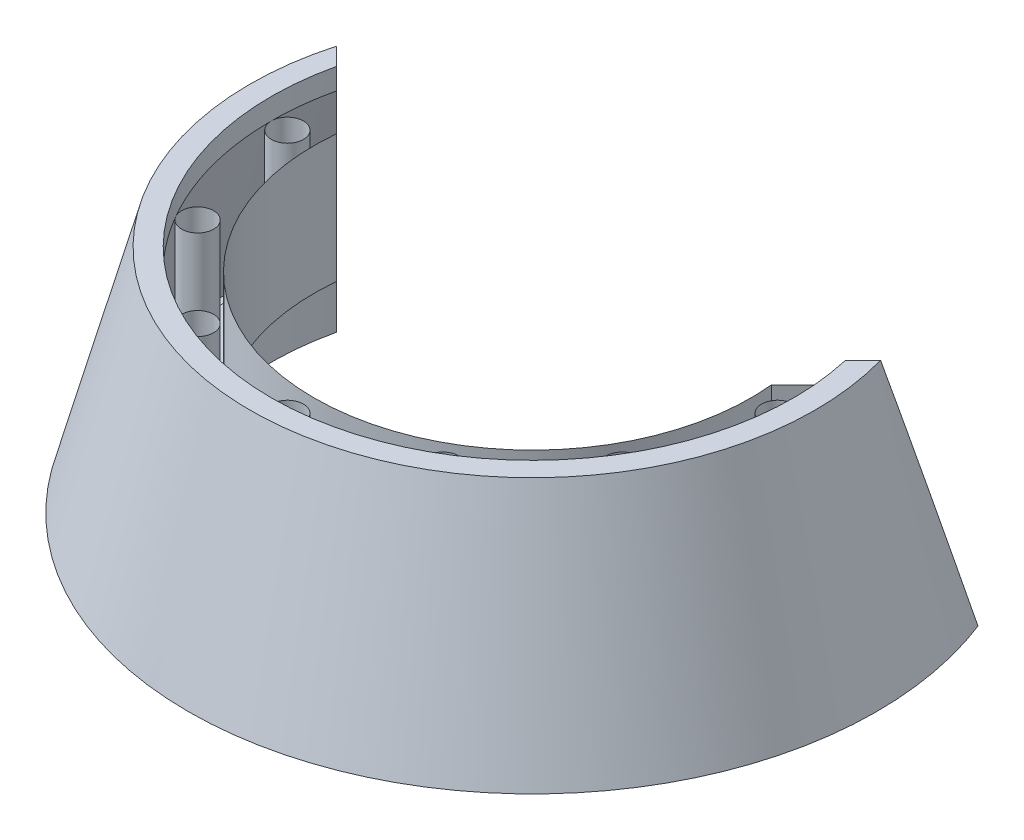
ISO-10303-21;
HEADER;
FILE_DESCRIPTION(('STEP AP214'),'2;1');
FILE_NAME('part.step','',(''),(''),'','','');
FILE_SCHEMA(('AUTOMOTIVE_DESIGN { 1 0 10303 214 1 1 1 1 }'));
ENDSEC;
DATA;
#1=APPLICATION_CONTEXT('core data for automotive mechanical design processes');
#2=APPLICATION_PROTOCOL_DEFINITION('international standard','automotive_design',2000,#1);
#3=PRODUCT_CONTEXT('',#1,'mechanical');
#4=PRODUCT('Part','Part','',(#3));
#5=PRODUCT_RELATED_PRODUCT_CATEGORY('part','',(#4));
#6=PRODUCT_DEFINITION_FORMATION('','',#4);
#7=PRODUCT_DEFINITION_CONTEXT('part definition',#1,'design');
#8=PRODUCT_DEFINITION('design','',#6,#7);
#9=PRODUCT_DEFINITION_SHAPE('','',#8);
#10=(LENGTH_UNIT() NAMED_UNIT(*) SI_UNIT(.MILLI.,.METRE.));
#11=(NAMED_UNIT(*) PLANE_ANGLE_UNIT() SI_UNIT($,.RADIAN.));
#12=(NAMED_UNIT(*) SI_UNIT($,.STERADIAN.) SOLID_ANGLE_UNIT());
#13=UNCERTAINTY_MEASURE_WITH_UNIT(LENGTH_MEASURE(1.E-05),#10,'distance_accuracy_value','');
#14=(GEOMETRIC_REPRESENTATION_CONTEXT(3) GLOBAL_UNCERTAINTY_ASSIGNED_CONTEXT((#13)) GLOBAL_UNIT_ASSIGNED_CONTEXT((#10,
#11,#12)) REPRESENTATION_CONTEXT('',''));
#15=CARTESIAN_POINT('',(0.,0.,0.));
#16=DIRECTION('',(0.,0.,1.));
#17=DIRECTION('',(1.,0.,0.));
#18=AXIS2_PLACEMENT_3D('',#15,#16,#17);
#19=CARTESIAN_POINT('',(0.,-19.05,-77.7875));
#20=DIRECTION('',(0.,-1.,0.));
#21=DIRECTION('',(0.,0.,-1.));
#22=AXIS2_PLACEMENT_3D('',#19,#20,#21);
#23=PLANE('',#22);
#24=DIRECTION('',(-0.707106781186546,0.,-0.707106781186549));
#25=VECTOR('',#24,1.);
#26=CARTESIAN_POINT('',(-68.0795823934747,-19.05,-9.70791760652553));
#27=LINE('',#26,#25);
#28=CARTESIAN_POINT('',(-64.7720448306673,-19.05,-6.40038004371812));
#29=VERTEX_POINT('',#28);
#30=CARTESIAN_POINT('',(-75.8080885124679,-19.05,-17.4364237255188));
#31=VERTEX_POINT('',#30);
#32=EDGE_CURVE('E61',#29,#31,#27,.T.);
#33=ORIENTED_EDGE('',*,*,#32,.F.);
#34=CARTESIAN_POINT('',(0.,-19.05,0.));
#35=DIRECTION('',(0.,-1.,0.));
#36=DIRECTION('',(0.,0.,-1.));
#37=AXIS2_PLACEMENT_3D('',#34,#35,#36);
#38=CIRCLE('',#37,65.0875);
#39=CARTESIAN_POINT('',(64.7720448306673,-19.05,-6.4003800437177));
#40=VERTEX_POINT('',#39);
#41=EDGE_CURVE('E194',#40,#29,#38,.T.);
#42=ORIENTED_EDGE('',*,*,#41,.F.);
#43=DIRECTION('',(-0.707106781186549,0.,0.707106781186546));
#44=VECTOR('',#43,1.);
#45=CARTESIAN_POINT('',(68.0795823934747,-19.05,-9.70791760652506));
#46=LINE('',#45,#44);
#47=CARTESIAN_POINT('',(75.808088512468,-19.05,-17.4364237255183));
#48=VERTEX_POINT('',#47);
#49=EDGE_CURVE('E163',#48,#40,#46,.T.);
#50=ORIENTED_EDGE('',*,*,#49,.F.);
#51=CARTESIAN_POINT('',(0.,-19.05,0.));
#52=DIRECTION('',(0.,-1.,0.));
#53=DIRECTION('',(0.,0.,-1.));
#54=AXIS2_PLACEMENT_3D('',#51,#52,#53);
#55=CIRCLE('',#54,77.7875);
#56=CARTESIAN_POINT('',(77.7875,-19.05,8.07034740519042E-13));
#57=VERTEX_POINT('',#56);
#58=EDGE_CURVE('E205',#48,#57,#55,.T.);
#59=ORIENTED_EDGE('',*,*,#58,.T.);
#60=CARTESIAN_POINT('',(73.025,-19.05,7.55953291056286E-13));
#61=DIRECTION('',(0.,-1.,0.));
#62=DIRECTION('',(0.,0.,-1.));
#63=AXIS2_PLACEMENT_3D('',#60,#61,#62);
#64=CIRCLE('',#63,4.76249999999999);
#65=EDGE_CURVE('E316',#57,#57,#64,.T.);
#66=ORIENTED_EDGE('',*,*,#65,.F.);
#67=CARTESIAN_POINT('',(67.3659510968816,-19.05,38.8937500000008));
#68=VERTEX_POINT('',#67);
#69=EDGE_CURVE('E214',#57,#68,#55,.T.);
#70=ORIENTED_EDGE('',*,*,#69,.T.);
#71=CARTESIAN_POINT('',(63.2415051113582,-19.05,36.5125000000007));
#72=DIRECTION('',(0.,-1.,0.));
#73=DIRECTION('',(0.,0.,-1.));
#74=AXIS2_PLACEMENT_3D('',#71,#72,#73);
#75=CIRCLE('',#74,4.76249999999999);
#76=EDGE_CURVE('E313',#68,#68,#75,.T.);
#77=ORIENTED_EDGE('',*,*,#76,.F.);
#78=CARTESIAN_POINT('',(38.8937499999991,-19.05,67.3659510968825));
#79=VERTEX_POINT('',#78);
#80=EDGE_CURVE('E222',#68,#79,#55,.T.);
#81=ORIENTED_EDGE('',*,*,#80,.T.);
#82=CARTESIAN_POINT('',(36.5124999999992,-19.05,63.2415051113591));
#83=DIRECTION('',(0.,-1.,0.));
#84=DIRECTION('',(0.,0.,-1.));
#85=AXIS2_PLACEMENT_3D('',#82,#83,#84);
#86=CIRCLE('',#85,4.76249999999999);
#87=EDGE_CURVE('E310',#79,#79,#86,.T.);
#88=ORIENTED_EDGE('',*,*,#87,.F.);
#89=CARTESIAN_POINT('',(0.,-19.05,77.7875));
#90=VERTEX_POINT('',#89);
#91=EDGE_CURVE('E217',#79,#90,#55,.T.);
#92=ORIENTED_EDGE('',*,*,#91,.T.);
#93=CARTESIAN_POINT('',(0.,-19.05,73.025));
#94=DIRECTION('',(0.,-1.,0.));
#95=DIRECTION('',(0.,0.,-1.));
#96=AXIS2_PLACEMENT_3D('',#93,#94,#95);
#97=CIRCLE('',#96,4.76249999999999);
#98=EDGE_CURVE('E225',#90,#90,#97,.T.);
#99=ORIENTED_EDGE('',*,*,#98,.F.);
#100=CARTESIAN_POINT('',(-38.8937500000001,-19.05,67.365951096882));
#101=VERTEX_POINT('',#100);
#102=EDGE_CURVE('E176',#90,#101,#55,.T.);
#103=ORIENTED_EDGE('',*,*,#102,.T.);
#104=CARTESIAN_POINT('',(-36.5125000000001,-19.05,63.2415051113586));
#105=DIRECTION('',(0.,-1.,0.));
#106=DIRECTION('',(0.,0.,-1.));
#107=AXIS2_PLACEMENT_3D('',#104,#105,#106);
#108=CIRCLE('',#107,4.76249999999999);
#109=EDGE_CURVE('E307',#101,#101,#108,.T.);
#110=ORIENTED_EDGE('',*,*,#109,.F.);
#111=CARTESIAN_POINT('',(-67.3659510968821,-19.05,38.8937499999999));
#112=VERTEX_POINT('',#111);
#113=EDGE_CURVE('E228',#101,#112,#55,.T.);
#114=ORIENTED_EDGE('',*,*,#113,.T.);
#115=CARTESIAN_POINT('',(-63.2415051113587,-19.05,36.5124999999999));
#116=DIRECTION('',(0.,-1.,0.));
#117=DIRECTION('',(0.,0.,-1.));
#118=AXIS2_PLACEMENT_3D('',#115,#116,#117);
#119=CIRCLE('',#118,4.76249999999999);
#120=EDGE_CURVE('E242',#112,#112,#119,.T.);
#121=ORIENTED_EDGE('',*,*,#120,.F.);
#122=CARTESIAN_POINT('',(-77.7875,-19.05,-2.62067383356393E-13));
#123=VERTEX_POINT('',#122);
#124=EDGE_CURVE('E221',#112,#123,#55,.T.);
#125=ORIENTED_EDGE('',*,*,#124,.T.);
#126=CARTESIAN_POINT('',(-73.025,-19.05,-2.46022441518246E-13));
#127=DIRECTION('',(0.,-1.,0.));
#128=DIRECTION('',(0.,0.,-1.));
#129=AXIS2_PLACEMENT_3D('',#126,#127,#128);
#130=CIRCLE('',#129,4.76249999999999);
#131=EDGE_CURVE('E240',#123,#123,#130,.T.);
#132=ORIENTED_EDGE('',*,*,#131,.F.);
#133=EDGE_CURVE('E216',#123,#31,#55,.T.);
#134=ORIENTED_EDGE('',*,*,#133,.T.);
#135=EDGE_LOOP('',(#33,#42,#50,#59,#66,#70,#77,#81,#88,#92,#99,#103,#110,#114,#121,#125,#132,#134));
#136=FACE_BOUND('',#135,.T.);
#137=ADVANCED_FACE('F39',(#136),#23,.T.);
#138=CARTESIAN_POINT('',(0.,-44.45,0.));
#139=DIRECTION('',(0.,-1.,0.));
#140=DIRECTION('',(0.,0.,-1.));
#141=AXIS2_PLACEMENT_3D('',#138,#139,#140);
#142=CYLINDRICAL_SURFACE('',#141,65.0875);
#143=DIRECTION('',(0.,-1.,0.));
#144=VECTOR('',#143,1.);
#145=CARTESIAN_POINT('',(-64.7720448306673,-44.45,-6.40038004371813));
#146=LINE('',#145,#144);
#147=CARTESIAN_POINT('',(-64.7720448306673,19.05,-6.40038004371813));
#148=VERTEX_POINT('',#147);
#149=EDGE_CURVE('E244',#148,#29,#146,.T.);
#150=ORIENTED_EDGE('',*,*,#149,.F.);
#151=CARTESIAN_POINT('',(0.,19.05,0.));
#152=DIRECTION('',(0.,-1.,0.));
#153=DIRECTION('',(0.,0.,-1.));
#154=AXIS2_PLACEMENT_3D('',#151,#152,#153);
#155=CIRCLE('',#154,65.0875);
#156=CARTESIAN_POINT('',(64.7720448306673,19.05,-6.40038004371773));
#157=VERTEX_POINT('',#156);
#158=EDGE_CURVE('E188',#157,#148,#155,.T.);
#159=ORIENTED_EDGE('',*,*,#158,.F.);
#160=DIRECTION('',(0.,-1.,0.));
#161=VECTOR('',#160,1.);
#162=CARTESIAN_POINT('',(64.7720448306673,-44.45,-6.40038004371773));
#163=LINE('',#162,#161);
#164=EDGE_CURVE('E208',#40,#157,#163,.F.);
#165=ORIENTED_EDGE('',*,*,#164,.F.);
#166=ORIENTED_EDGE('',*,*,#41,.T.);
#167=EDGE_LOOP('',(#150,#159,#165,#166));
#168=FACE_BOUND('',#167,.T.);
#169=ADVANCED_FACE('F248',(#168),#142,.F.);
#170=CARTESIAN_POINT('',(0.,19.05,-65.0875));
#171=DIRECTION('',(0.,1.,0.));
#172=DIRECTION('',(0.,0.,1.));
#173=AXIS2_PLACEMENT_3D('',#170,#171,#172);
#174=PLANE('',#173);
#175=DIRECTION('',(0.707106781186546,0.,0.707106781186549));
#176=VECTOR('',#175,1.);
#177=CARTESIAN_POINT('',(-61.7295823934747,19.05,-3.35791760652552));
#178=LINE('',#177,#176);
#179=CARTESIAN_POINT('',(-75.8080885124679,19.05,-17.4364237255188));
#180=VERTEX_POINT('',#179);
#181=EDGE_CURVE('E413',#180,#148,#178,.T.);
#182=ORIENTED_EDGE('',*,*,#181,.F.);
#183=CARTESIAN_POINT('',(0.,19.05,0.));
#184=DIRECTION('',(0.,-1.,0.));
#185=DIRECTION('',(0.,0.,-1.));
#186=AXIS2_PLACEMENT_3D('',#183,#184,#185);
#187=CIRCLE('',#186,77.7875);
#188=CARTESIAN_POINT('',(-77.7875,19.05,-2.62067383356393E-13));
#189=VERTEX_POINT('',#188);
#190=EDGE_CURVE('E361',#189,#180,#187,.T.);
#191=ORIENTED_EDGE('',*,*,#190,.F.);
#192=CARTESIAN_POINT('',(-73.025,19.05,-2.46022441518246E-13));
#193=DIRECTION('',(0.,1.,0.));
#194=DIRECTION('',(-1.,0.,0.));
#195=AXIS2_PLACEMENT_3D('',#192,#193,#194);
#196=CIRCLE('',#195,4.76249999999999);
#197=EDGE_CURVE('E299',#189,#189,#196,.T.);
#198=ORIENTED_EDGE('',*,*,#197,.F.);
#199=CARTESIAN_POINT('',(-67.3659510968821,19.05,38.8937499999998));
#200=VERTEX_POINT('',#199);
#201=EDGE_CURVE('E365',#200,#189,#187,.T.);
#202=ORIENTED_EDGE('',*,*,#201,.F.);
#203=CARTESIAN_POINT('',(-63.2415051113587,19.05,36.5124999999999));
#204=DIRECTION('',(0.,1.,0.));
#205=DIRECTION('',(-0.86602540378444,0.,0.499999999999998));
#206=AXIS2_PLACEMENT_3D('',#203,#204,#205);
#207=CIRCLE('',#206,4.76249999999999);
#208=EDGE_CURVE('E295',#200,#200,#207,.T.);
#209=ORIENTED_EDGE('',*,*,#208,.F.);
#210=CARTESIAN_POINT('',(-38.8937500000001,19.05,67.365951096882));
#211=VERTEX_POINT('',#210);
#212=EDGE_CURVE('E189',#211,#200,#187,.T.);
#213=ORIENTED_EDGE('',*,*,#212,.F.);
#214=CARTESIAN_POINT('',(-36.5125000000001,19.05,63.2415051113586));
#215=DIRECTION('',(0.,1.,0.));
#216=DIRECTION('',(-0.500000000000001,0.,0.866025403784438));
#217=AXIS2_PLACEMENT_3D('',#214,#215,#216);
#218=CIRCLE('',#217,4.76249999999999);
#219=EDGE_CURVE('E298',#211,#211,#218,.T.);
#220=ORIENTED_EDGE('',*,*,#219,.F.);
#221=CARTESIAN_POINT('',(0.,19.05,77.7875));
#222=VERTEX_POINT('',#221);
#223=EDGE_CURVE('E184',#222,#211,#187,.T.);
#224=ORIENTED_EDGE('',*,*,#223,.F.);
#225=CARTESIAN_POINT('',(0.,19.05,73.025));
#226=DIRECTION('',(0.,1.,0.));
#227=DIRECTION('',(0.,0.,1.));
#228=AXIS2_PLACEMENT_3D('',#225,#226,#227);
#229=CIRCLE('',#228,4.76249999999999);
#230=EDGE_CURVE('E323',#222,#222,#229,.T.);
#231=ORIENTED_EDGE('',*,*,#230,.F.);
#232=CARTESIAN_POINT('',(38.8937499999991,19.05,67.3659510968825));
#233=VERTEX_POINT('',#232);
#234=EDGE_CURVE('E183',#233,#222,#187,.T.);
#235=ORIENTED_EDGE('',*,*,#234,.F.);
#236=CARTESIAN_POINT('',(36.5124999999992,19.05,63.2415051113591));
#237=DIRECTION('',(0.,1.,0.));
#238=DIRECTION('',(0.499999999999989,0.,0.866025403784445));
#239=AXIS2_PLACEMENT_3D('',#236,#237,#238);
#240=CIRCLE('',#239,4.76249999999999);
#241=EDGE_CURVE('E286',#233,#233,#240,.T.);
#242=ORIENTED_EDGE('',*,*,#241,.F.);
#243=CARTESIAN_POINT('',(67.3659510968816,19.05,38.8937500000008));
#244=VERTEX_POINT('',#243);
#245=EDGE_CURVE('E352',#244,#233,#187,.T.);
#246=ORIENTED_EDGE('',*,*,#245,.F.);
#247=CARTESIAN_POINT('',(63.2415051113582,19.05,36.5125000000007));
#248=DIRECTION('',(0.,1.,0.));
#249=DIRECTION('',(0.866025403784433,0.,0.50000000000001));
#250=AXIS2_PLACEMENT_3D('',#247,#248,#249);
#251=CIRCLE('',#250,4.76249999999999);
#252=EDGE_CURVE('E289',#244,#244,#251,.T.);
#253=ORIENTED_EDGE('',*,*,#252,.F.);
#254=CARTESIAN_POINT('',(77.7875,19.05,8.05254592646913E-13));
#255=VERTEX_POINT('',#254);
#256=EDGE_CURVE('E349',#255,#244,#187,.T.);
#257=ORIENTED_EDGE('',*,*,#256,.F.);
#258=CARTESIAN_POINT('',(73.025,19.05,7.55953291056286E-13));
#259=DIRECTION('',(0.,1.,0.));
#260=DIRECTION('',(1.,0.,0.));
#261=AXIS2_PLACEMENT_3D('',#258,#259,#260);
#262=CIRCLE('',#261,4.76249999999999);
#263=EDGE_CURVE('E292',#255,#255,#262,.T.);
#264=ORIENTED_EDGE('',*,*,#263,.F.);
#265=CARTESIAN_POINT('',(75.808088512468,19.05,-17.4364237255183));
#266=VERTEX_POINT('',#265);
#267=EDGE_CURVE('E190',#266,#255,#187,.T.);
#268=ORIENTED_EDGE('',*,*,#267,.F.);
#269=DIRECTION('',(0.707106781186549,0.,-0.707106781186546));
#270=VECTOR('',#269,1.);
#271=CARTESIAN_POINT('',(61.7295823934747,19.05,-3.3579176065251));
#272=LINE('',#271,#270);
#273=EDGE_CURVE('E252',#157,#266,#272,.T.);
#274=ORIENTED_EDGE('',*,*,#273,.F.);
#275=ORIENTED_EDGE('',*,*,#158,.T.);
#276=EDGE_LOOP('',(#182,#191,#198,#202,#209,#213,#220,#224,#231,#235,#242,#246,#253,#257,#264,
#268,#274,#275));
#277=FACE_BOUND('',#276,.T.);
#278=ADVANCED_FACE('F346',(#277),#174,.T.);
#279=CARTESIAN_POINT('',(0.,-44.45,0.));
#280=DIRECTION('',(0.,-1.,0.));
#281=DIRECTION('',(0.,0.,-1.));
#282=AXIS2_PLACEMENT_3D('',#279,#280,#281);
#283=CYLINDRICAL_SURFACE('',#282,77.7875);
#284=DIRECTION('',(0.,-1.,0.));
#285=VECTOR('',#284,1.);
#286=CARTESIAN_POINT('',(-75.8080885124679,-44.45,-17.4364237255188));
#287=LINE('',#286,#285);
#288=CARTESIAN_POINT('',(-75.8080885124679,25.4,-17.4364237255188));
#289=VERTEX_POINT('',#288);
#290=EDGE_CURVE('E287',#289,#180,#287,.T.);
#291=ORIENTED_EDGE('',*,*,#290,.F.);
#292=CARTESIAN_POINT('',(0.,25.4,0.));
#293=DIRECTION('',(0.,-1.,0.));
#294=DIRECTION('',(0.,0.,-1.));
#295=AXIS2_PLACEMENT_3D('',#292,#293,#294);
#296=CIRCLE('',#295,77.7875);
#297=CARTESIAN_POINT('',(75.808088512468,25.4,-17.4364237255183));
#298=VERTEX_POINT('',#297);
#299=EDGE_CURVE('E174',#298,#289,#296,.T.);
#300=ORIENTED_EDGE('',*,*,#299,.F.);
#301=DIRECTION('',(0.,-1.,0.));
#302=VECTOR('',#301,1.);
#303=CARTESIAN_POINT('',(75.808088512468,-44.45,-17.4364237255183));
#304=LINE('',#303,#302);
#305=EDGE_CURVE('E152',#266,#298,#304,.F.);
#306=ORIENTED_EDGE('',*,*,#305,.F.);
#307=ORIENTED_EDGE('',*,*,#267,.T.);
#308=ORIENTED_EDGE('',*,*,#256,.T.);
#309=ORIENTED_EDGE('',*,*,#245,.T.);
#310=ORIENTED_EDGE('',*,*,#234,.T.);
#311=ORIENTED_EDGE('',*,*,#223,.T.);
#312=ORIENTED_EDGE('',*,*,#212,.T.);
#313=ORIENTED_EDGE('',*,*,#201,.T.);
#314=ORIENTED_EDGE('',*,*,#190,.T.);
#315=EDGE_LOOP('',(#291,#300,#306,#307,#308,#309,#310,#311,#312,#313,#314));
#316=FACE_BOUND('',#315,.T.);
#317=ADVANCED_FACE('F357',(#316),#283,.F.);
#318=CARTESIAN_POINT('',(0.,25.4,-77.7875));
#319=DIRECTION('',(0.,1.,0.));
#320=DIRECTION('',(0.,0.,1.));
#321=AXIS2_PLACEMENT_3D('',#318,#319,#320);
#322=PLANE('',#321);
#323=DIRECTION('',(0.707106781186546,0.,0.707106781186549));
#324=VECTOR('',#323,1.);
#325=CARTESIAN_POINT('',(0.,25.4,58.3716647869494));
#326=LINE('',#325,#324);
#327=CARTESIAN_POINT('',(-81.0293145356399,25.4,-22.6576497486907));
#328=VERTEX_POINT('',#327);
#329=EDGE_CURVE('E404',#328,#289,#326,.T.);
#330=ORIENTED_EDGE('',*,*,#329,.F.);
#331=CARTESIAN_POINT('',(0.,25.4,0.));
#332=DIRECTION('',(0.,-1.,0.));
#333=DIRECTION('',(0.,0.,-1.));
#334=AXIS2_PLACEMENT_3D('',#331,#332,#333);
#335=CIRCLE('',#334,84.1375);
#336=CARTESIAN_POINT('',(81.02931453564,25.4,-22.6576497486903));
#337=VERTEX_POINT('',#336);
#338=EDGE_CURVE('E170',#337,#328,#335,.T.);
#339=ORIENTED_EDGE('',*,*,#338,.F.);
#340=DIRECTION('',(0.707106781186549,0.,-0.707106781186546));
#341=VECTOR('',#340,1.);
#342=CARTESIAN_POINT('',(0.,25.4,58.3716647869494));
#343=LINE('',#342,#341);
#344=EDGE_CURVE('E146',#298,#337,#343,.T.);
#345=ORIENTED_EDGE('',*,*,#344,.F.);
#346=ORIENTED_EDGE('',*,*,#299,.T.);
#347=EDGE_LOOP('',(#330,#339,#345,#346));
#348=FACE_BOUND('',#347,.T.);
#349=ADVANCED_FACE('F397',(#348),#322,.T.);
#350=CARTESIAN_POINT('',(0.,-43.18,0.));
#351=DIRECTION('',(0.,-1.,0.));
#352=DIRECTION('',(0.,0.,-1.));
#353=AXIS2_PLACEMENT_3D('',#350,#351,#352);
#354=CONICAL_SURFACE('',#353,102.513455616926,0.261799387799146);
#355=CARTESIAN_POINT('',(-95.538654281038,-43.1802,-37.1669894940889));
#356=CARTESIAN_POINT('',(-94.9461315365219,-40.3176112632735,-36.5744667495728));
#357=CARTESIAN_POINT('',(-94.3524292604613,-37.4555112188946,-35.9807644735123));
#358=CARTESIAN_POINT('',(-93.1624544624114,-31.7323789536326,-34.7907896754623));
#359=CARTESIAN_POINT('',(-92.5661819395329,-28.8713467331193,-34.1945171525838));
#360=CARTESIAN_POINT('',(-90.7732066409382,-20.2900564774931,-32.4015418539891));
#361=CARTESIAN_POINT('',(-89.5723324649116,-14.5715387529761,-31.2006676779626));
#362=CARTESIAN_POINT('',(-87.7610908628324,-5.99794864187953,-29.3894260758833));
#363=CARTESIAN_POINT('',(-87.1556874669494,-3.14077769034308,-28.7840226800003));
#364=CARTESIAN_POINT('',(-85.9412453286322,2.57201833314958,-27.5695805416831));
#365=CARTESIAN_POINT('',(-85.3322065871283,5.42764340550113,-26.9605418001792));
#366=CARTESIAN_POINT('',(-84.1101313245328,11.1372171150471,-25.7384665375837));
#367=CARTESIAN_POINT('',(-83.497094759384,13.9911657333873,-25.1254299724349));
#368=CARTESIAN_POINT('',(-82.2666032302887,19.6971601152987,-23.8949384433396));
#369=CARTESIAN_POINT('',(-81.6491482620449,22.5492058770163,-23.2774834750958));
#370=CARTESIAN_POINT('',(-81.0292710497926,25.4002,-22.6576062628435));
#371=B_SPLINE_CURVE_WITH_KNOTS('',3,(#355,#356,#357,#358,#359,#360,#361,#362,#363,#364,#365,
#366,#367,#368,#369,#370),.UNSPECIFIED.,.F.,.F.,(4,2,2,2,2,2,2,4),(0.,8.94813944790118,
17.8962819909927,35.7923604836335,44.7404331213552,53.6885034696757,62.6366725960269,
71.5848504265783),.UNSPECIFIED.);
#372=CARTESIAN_POINT('',(-95.5386128835321,-43.18,-37.1669480965829));
#373=VERTEX_POINT('',#372);
#374=EDGE_CURVE('E168',#373,#328,#371,.T.);
#375=ORIENTED_EDGE('',*,*,#374,.F.);
#376=CARTESIAN_POINT('',(0.,-43.18,0.));
#377=DIRECTION('',(0.,-1.,0.));
#378=DIRECTION('',(0.,0.,-1.));
#379=AXIS2_PLACEMENT_3D('',#376,#377,#378);
#380=CIRCLE('',#379,102.513455616926);
#381=CARTESIAN_POINT('',(95.5386128835322,-43.18,-37.1669480965825));
#382=VERTEX_POINT('',#381);
#383=EDGE_CURVE('E159',#382,#373,#380,.T.);
#384=ORIENTED_EDGE('',*,*,#383,.F.);
#385=CARTESIAN_POINT('',(81.0292710497927,25.4002,-22.657606262843));
#386=CARTESIAN_POINT('',(81.6491482620451,22.5492058770163,-23.2774834750954));
#387=CARTESIAN_POINT('',(82.2666032302888,19.6971601152987,-23.8949384433392));
#388=CARTESIAN_POINT('',(83.4970947593841,13.9911657333873,-25.1254299724344));
#389=CARTESIAN_POINT('',(84.1101313245329,11.1372171150471,-25.7384665375833));
#390=CARTESIAN_POINT('',(85.3322065871284,5.42764340550114,-26.9605418001787));
#391=CARTESIAN_POINT('',(85.9412453286324,2.5720183331496,-27.5695805416827));
#392=CARTESIAN_POINT('',(87.1556874669495,-3.14077769034306,-28.7840226799999));
#393=CARTESIAN_POINT('',(87.7610908628325,-5.99794864187951,-29.3894260758829));
#394=CARTESIAN_POINT('',(89.5723324649118,-14.5715387529761,-31.2006676779621));
#395=CARTESIAN_POINT('',(90.7732066409383,-20.2900564774931,-32.4015418539886));
#396=CARTESIAN_POINT('',(92.5661819395331,-28.8713467331193,-34.1945171525834));
#397=CARTESIAN_POINT('',(93.1624544624115,-31.7323789536326,-34.7907896754618));
#398=CARTESIAN_POINT('',(94.3524292604615,-37.4555112188946,-35.9807644735118));
#399=CARTESIAN_POINT('',(94.946131536522,-40.3176112632735,-36.5744667495723));
#400=CARTESIAN_POINT('',(95.5386542810382,-43.1802,-37.1669894940885));
#401=B_SPLINE_CURVE_WITH_KNOTS('',3,(#385,#386,#387,#388,#389,#390,#391,#392,#393,#394,#395,
#396,#397,#398,#399,#400),.UNSPECIFIED.,.F.,.F.,(4,2,2,2,2,2,2,4),(0.,8.94817783055134,
17.8963469569026,26.8444173052231,35.7924899429448,53.6885684355856,62.6367109786771,
71.5848504265783),.UNSPECIFIED.);
#402=EDGE_CURVE('E143',#337,#382,#401,.T.);
#403=ORIENTED_EDGE('',*,*,#402,.F.);
#404=ORIENTED_EDGE('',*,*,#338,.T.);
#405=EDGE_LOOP('',(#375,#384,#403,#404));
#406=FACE_BOUND('',#405,.T.);
#407=ADVANCED_FACE('F167',(#406),#354,.T.);
#408=CARTESIAN_POINT('',(0.,-43.18,-102.513455616926));
#409=DIRECTION('',(0.,-1.,0.));
#410=DIRECTION('',(0.,0.,-1.));
#411=AXIS2_PLACEMENT_3D('',#408,#409,#410);
#412=PLANE('',#411);
#413=DIRECTION('',(0.707106781186546,0.,0.707106781186549));
#414=VECTOR('',#413,1.);
#415=CARTESIAN_POINT('',(0.,-43.18,58.3716647869494));
#416=LINE('',#415,#414);
#417=CARTESIAN_POINT('',(-75.8080885124679,-43.18,-17.4364237255188));
#418=VERTEX_POINT('',#417);
#419=EDGE_CURVE('E164',#373,#418,#416,.T.);
#420=ORIENTED_EDGE('',*,*,#419,.T.);
#421=CARTESIAN_POINT('',(0.,-43.18,0.));
#422=DIRECTION('',(0.,-1.,0.));
#423=DIRECTION('',(0.,0.,-1.));
#424=AXIS2_PLACEMENT_3D('',#421,#422,#423);
#425=CIRCLE('',#424,77.7875);
#426=CARTESIAN_POINT('',(75.808088512468,-43.18,-17.4364237255183));
#427=VERTEX_POINT('',#426);
#428=EDGE_CURVE('E161',#427,#418,#425,.T.);
#429=ORIENTED_EDGE('',*,*,#428,.F.);
#430=DIRECTION('',(0.707106781186549,0.,-0.707106781186546));
#431=VECTOR('',#430,1.);
#432=CARTESIAN_POINT('',(0.,-43.18,58.3716647869494));
#433=LINE('',#432,#431);
#434=EDGE_CURVE('E54',#427,#382,#433,.T.);
#435=ORIENTED_EDGE('',*,*,#434,.T.);
#436=ORIENTED_EDGE('',*,*,#383,.T.);
#437=EDGE_LOOP('',(#420,#429,#435,#436));
#438=FACE_BOUND('',#437,.T.);
#439=ADVANCED_FACE('F158',(#438),#412,.T.);
#440=CARTESIAN_POINT('',(0.,-44.45,0.));
#441=DIRECTION('',(0.,-1.,0.));
#442=DIRECTION('',(0.,0.,-1.));
#443=AXIS2_PLACEMENT_3D('',#440,#441,#442);
#444=CYLINDRICAL_SURFACE('',#443,77.7875);
#445=DIRECTION('',(0.,-1.,0.));
#446=VECTOR('',#445,1.);
#447=CARTESIAN_POINT('',(-75.8080885124679,-44.45,-17.4364237255188));
#448=LINE('',#447,#446);
#449=EDGE_CURVE('E11',#31,#418,#448,.T.);
#450=ORIENTED_EDGE('',*,*,#449,.F.);
#451=ORIENTED_EDGE('',*,*,#133,.F.);
#452=ORIENTED_EDGE('',*,*,#124,.F.);
#453=ORIENTED_EDGE('',*,*,#113,.F.);
#454=ORIENTED_EDGE('',*,*,#102,.F.);
#455=ORIENTED_EDGE('',*,*,#91,.F.);
#456=ORIENTED_EDGE('',*,*,#80,.F.);
#457=ORIENTED_EDGE('',*,*,#69,.F.);
#458=ORIENTED_EDGE('',*,*,#58,.F.);
#459=DIRECTION('',(0.,-1.,0.));
#460=VECTOR('',#459,1.);
#461=CARTESIAN_POINT('',(75.808088512468,-44.45,-17.4364237255183));
#462=LINE('',#461,#460);
#463=EDGE_CURVE('E47',#427,#48,#462,.F.);
#464=ORIENTED_EDGE('',*,*,#463,.F.);
#465=ORIENTED_EDGE('',*,*,#428,.T.);
#466=EDGE_LOOP('',(#450,#451,#452,#453,#454,#455,#456,#457,#458,#464,#465));
#467=FACE_BOUND('',#466,.T.);
#468=ADVANCED_FACE('F211',(#467),#444,.F.);
#469=CARTESIAN_POINT('',(0.,-43.18,73.025));
#470=DIRECTION('',(0.,1.,0.));
#471=DIRECTION('',(0.,0.,1.));
#472=AXIS2_PLACEMENT_3D('',#469,#470,#471);
#473=CYLINDRICAL_SURFACE('',#472,4.76249999999999);
#474=ORIENTED_EDGE('',*,*,#98,.T.);
#475=EDGE_LOOP('',(#474));
#476=FACE_BOUND('',#475,.T.);
#477=ORIENTED_EDGE('',*,*,#230,.T.);
#478=EDGE_LOOP('',(#477));
#479=FACE_BOUND('',#478,.T.);
#480=ADVANCED_FACE('F329',(#476,#479),#473,.F.);
#481=CARTESIAN_POINT('',(-36.5125000000001,-43.18,63.2415051113586));
#482=DIRECTION('',(0.,1.,0.));
#483=DIRECTION('',(0.,0.,1.));
#484=AXIS2_PLACEMENT_3D('',#481,#482,#483);
#485=CYLINDRICAL_SURFACE('',#484,4.76249999999999);
#486=ORIENTED_EDGE('',*,*,#109,.T.);
#487=EDGE_LOOP('',(#486));
#488=FACE_BOUND('',#487,.T.);
#489=ORIENTED_EDGE('',*,*,#219,.T.);
#490=EDGE_LOOP('',(#489));
#491=FACE_BOUND('',#490,.T.);
#492=ADVANCED_FACE('F423',(#488,#491),#485,.F.);
#493=CARTESIAN_POINT('',(36.5124999999992,-43.18,63.2415051113591));
#494=DIRECTION('',(0.,1.,0.));
#495=DIRECTION('',(0.,0.,1.));
#496=AXIS2_PLACEMENT_3D('',#493,#494,#495);
#497=CYLINDRICAL_SURFACE('',#496,4.76249999999999);
#498=ORIENTED_EDGE('',*,*,#87,.T.);
#499=EDGE_LOOP('',(#498));
#500=FACE_BOUND('',#499,.T.);
#501=ORIENTED_EDGE('',*,*,#241,.T.);
#502=EDGE_LOOP('',(#501));
#503=FACE_BOUND('',#502,.T.);
#504=ADVANCED_FACE('F340',(#500,#503),#497,.F.);
#505=CARTESIAN_POINT('',(63.2415051113582,-43.18,36.5125000000007));
#506=DIRECTION('',(0.,1.,0.));
#507=DIRECTION('',(0.,0.,1.));
#508=AXIS2_PLACEMENT_3D('',#505,#506,#507);
#509=CYLINDRICAL_SURFACE('',#508,4.76249999999999);
#510=ORIENTED_EDGE('',*,*,#76,.T.);
#511=EDGE_LOOP('',(#510));
#512=FACE_BOUND('',#511,.T.);
#513=ORIENTED_EDGE('',*,*,#252,.T.);
#514=EDGE_LOOP('',(#513));
#515=FACE_BOUND('',#514,.T.);
#516=ADVANCED_FACE('F276',(#512,#515),#509,.F.);
#517=CARTESIAN_POINT('',(73.025,-43.18,7.55953291056286E-13));
#518=DIRECTION('',(0.,1.,0.));
#519=DIRECTION('',(0.,0.,1.));
#520=AXIS2_PLACEMENT_3D('',#517,#518,#519);
#521=CYLINDRICAL_SURFACE('',#520,4.76249999999999);
#522=ORIENTED_EDGE('',*,*,#65,.T.);
#523=EDGE_LOOP('',(#522));
#524=FACE_BOUND('',#523,.T.);
#525=ORIENTED_EDGE('',*,*,#263,.T.);
#526=EDGE_LOOP('',(#525));
#527=FACE_BOUND('',#526,.T.);
#528=ADVANCED_FACE('F339',(#524,#527),#521,.F.);
#529=CARTESIAN_POINT('',(-73.025,-43.18,-2.46022441518246E-13));
#530=DIRECTION('',(0.,1.,0.));
#531=DIRECTION('',(0.,0.,1.));
#532=AXIS2_PLACEMENT_3D('',#529,#530,#531);
#533=CYLINDRICAL_SURFACE('',#532,4.76249999999999);
#534=ORIENTED_EDGE('',*,*,#131,.T.);
#535=EDGE_LOOP('',(#534));
#536=FACE_BOUND('',#535,.T.);
#537=ORIENTED_EDGE('',*,*,#197,.T.);
#538=EDGE_LOOP('',(#537));
#539=FACE_BOUND('',#538,.T.);
#540=ADVANCED_FACE('F379',(#536,#539),#533,.F.);
#541=CARTESIAN_POINT('',(-63.2415051113587,-43.18,36.5124999999999));
#542=DIRECTION('',(0.,1.,0.));
#543=DIRECTION('',(0.,0.,1.));
#544=AXIS2_PLACEMENT_3D('',#541,#542,#543);
#545=CYLINDRICAL_SURFACE('',#544,4.76249999999999);
#546=ORIENTED_EDGE('',*,*,#120,.T.);
#547=EDGE_LOOP('',(#546));
#548=FACE_BOUND('',#547,.T.);
#549=ORIENTED_EDGE('',*,*,#208,.T.);
#550=EDGE_LOOP('',(#549));
#551=FACE_BOUND('',#550,.T.);
#552=ADVANCED_FACE('F272',(#548,#551),#545,.F.);
#553=CARTESIAN_POINT('',(0.,-43.18,58.3716647869494));
#554=DIRECTION('',(0.707106781186546,0.,0.707106781186549));
#555=DIRECTION('',(0.707106781186549,0.,-0.707106781186546));
#556=AXIS2_PLACEMENT_3D('',#553,#554,#555);
#557=PLANE('',#556);
#558=ORIENTED_EDGE('',*,*,#402,.T.);
#559=ORIENTED_EDGE('',*,*,#434,.F.);
#560=ORIENTED_EDGE('',*,*,#463,.T.);
#561=ORIENTED_EDGE('',*,*,#49,.T.);
#562=ORIENTED_EDGE('',*,*,#164,.T.);
#563=ORIENTED_EDGE('',*,*,#273,.T.);
#564=ORIENTED_EDGE('',*,*,#305,.T.);
#565=ORIENTED_EDGE('',*,*,#344,.T.);
#566=EDGE_LOOP('',(#558,#559,#560,#561,#562,#563,#564,#565));
#567=FACE_BOUND('',#566,.T.);
#568=ADVANCED_FACE('F144',(#567),#557,.F.);
#569=CARTESIAN_POINT('',(0.,-43.18,58.3716647869494));
#570=DIRECTION('',(-0.707106781186549,0.,0.707106781186546));
#571=DIRECTION('',(0.707106781186546,0.,0.707106781186549));
#572=AXIS2_PLACEMENT_3D('',#569,#570,#571);
#573=PLANE('',#572);
#574=ORIENTED_EDGE('',*,*,#374,.T.);
#575=ORIENTED_EDGE('',*,*,#329,.T.);
#576=ORIENTED_EDGE('',*,*,#290,.T.);
#577=ORIENTED_EDGE('',*,*,#181,.T.);
#578=ORIENTED_EDGE('',*,*,#149,.T.);
#579=ORIENTED_EDGE('',*,*,#32,.T.);
#580=ORIENTED_EDGE('',*,*,#449,.T.);
#581=ORIENTED_EDGE('',*,*,#419,.F.);
#582=EDGE_LOOP('',(#574,#575,#576,#577,#578,#579,#580,#581));
#583=FACE_BOUND('',#582,.T.);
#584=ADVANCED_FACE('F271',(#583),#573,.F.);
#585=CLOSED_SHELL('',(#137,#169,#278,#317,#349,#407,#439,#468,#480,#492,#504,#516,#528,#540,
#552,#568,#584));
#586=MANIFOLD_SOLID_BREP('B2',#585);
#587=ADVANCED_BREP_SHAPE_REPRESENTATION('',(#18,#586),#14);
#588=SHAPE_DEFINITION_REPRESENTATION(#9,#587);
ENDSEC;
END-ISO-10303-21;
